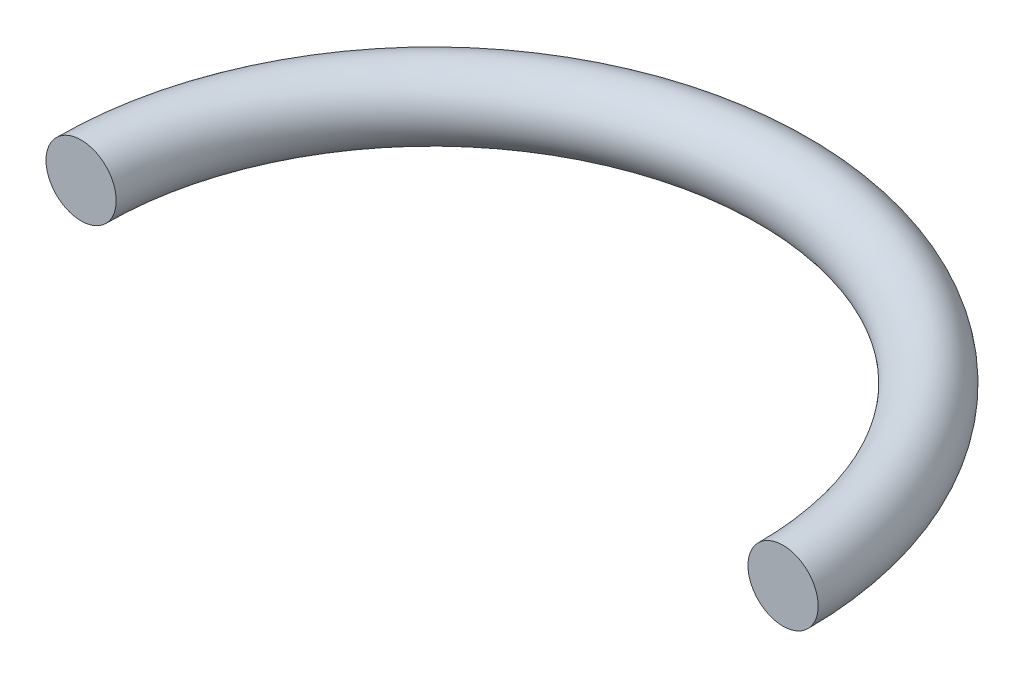
ISO-10303-21;
HEADER;
FILE_DESCRIPTION(('STEP AP214'),'2;1');
FILE_NAME('part.step','',(''),(''),'','','');
FILE_SCHEMA(('AUTOMOTIVE_DESIGN { 1 0 10303 214 1 1 1 1 }'));
ENDSEC;
DATA;
#1=APPLICATION_CONTEXT('core data for automotive mechanical design processes');
#2=APPLICATION_PROTOCOL_DEFINITION('international standard','automotive_design',2000,#1);
#3=PRODUCT_CONTEXT('',#1,'mechanical');
#4=PRODUCT('Part','Part','',(#3));
#5=PRODUCT_RELATED_PRODUCT_CATEGORY('part','',(#4));
#6=PRODUCT_DEFINITION_FORMATION('','',#4);
#7=PRODUCT_DEFINITION_CONTEXT('part definition',#1,'design');
#8=PRODUCT_DEFINITION('design','',#6,#7);
#9=PRODUCT_DEFINITION_SHAPE('','',#8);
#10=(LENGTH_UNIT() NAMED_UNIT(*) SI_UNIT(.MILLI.,.METRE.));
#11=(NAMED_UNIT(*) PLANE_ANGLE_UNIT() SI_UNIT($,.RADIAN.));
#12=(NAMED_UNIT(*) SI_UNIT($,.STERADIAN.) SOLID_ANGLE_UNIT());
#13=UNCERTAINTY_MEASURE_WITH_UNIT(LENGTH_MEASURE(1.E-05),#10,'distance_accuracy_value','');
#14=(GEOMETRIC_REPRESENTATION_CONTEXT(3) GLOBAL_UNCERTAINTY_ASSIGNED_CONTEXT((#13)) GLOBAL_UNIT_ASSIGNED_CONTEXT((#10,
#11,#12)) REPRESENTATION_CONTEXT('',''));
#15=CARTESIAN_POINT('',(0.,0.,0.));
#16=DIRECTION('',(0.,0.,1.));
#17=DIRECTION('',(1.,0.,0.));
#18=AXIS2_PLACEMENT_3D('',#15,#16,#17);
#19=CARTESIAN_POINT('',(0.,0.,0.));
#20=DIRECTION('',(0.,-1.,0.));
#21=DIRECTION('',(0.,0.,-1.));
#22=AXIS2_PLACEMENT_3D('',#19,#20,#21);
#23=TOROIDAL_SURFACE('',#22,50.,5.);
#24=CARTESIAN_POINT('',(-50.,0.,3.49148133884313E-13));
#25=DIRECTION('',(0.,0.,-1.));
#26=DIRECTION('',(-1.,0.,0.));
#27=AXIS2_PLACEMENT_3D('',#24,#25,#26);
#28=CIRCLE('',#27,5.);
#29=CARTESIAN_POINT('',(-55.,0.,3.84062947272745E-13));
#30=VERTEX_POINT('',#29);
#31=EDGE_CURVE('E10',#30,#30,#28,.T.);
#32=CARTESIAN_POINT('',(50.,0.,0.));
#33=DIRECTION('',(0.,0.,1.));
#34=DIRECTION('',(1.,0.,0.));
#35=AXIS2_PLACEMENT_3D('',#32,#33,#34);
#36=CIRCLE('',#35,5.);
#37=CARTESIAN_POINT('',(55.,0.,0.));
#38=VERTEX_POINT('',#37);
#39=EDGE_CURVE('E36',#38,#38,#36,.T.);
#40=CARTESIAN_POINT('',(0.,0.,0.));
#41=DIRECTION('',(0.,-1.,0.));
#42=DIRECTION('',(0.,0.,-1.));
#43=AXIS2_PLACEMENT_3D('',#40,#41,#42);
#44=CIRCLE('',#43,55.);
#45=EDGE_CURVE('',#30,#38,#44,.T.);
#46=ORIENTED_EDGE('',*,*,#31,.T.);
#47=ORIENTED_EDGE('',*,*,#39,.F.);
#48=ORIENTED_EDGE('',*,*,#45,.T.);
#49=ORIENTED_EDGE('',*,*,#45,.F.);
#50=EDGE_LOOP('',(#46,#48,#47,#49));
#51=FACE_BOUND('',#50,.T.);
#52=ADVANCED_FACE('F30',(#51),#23,.T.);
#53=CARTESIAN_POINT('',(-50.,0.,3.49148133884313E-13));
#54=DIRECTION('',(0.,0.,-1.));
#55=DIRECTION('',(-1.,0.,0.));
#56=AXIS2_PLACEMENT_3D('',#53,#54,#55);
#57=PLANE('',#56);
#58=ORIENTED_EDGE('',*,*,#31,.F.);
#59=EDGE_LOOP('',(#58));
#60=FACE_BOUND('',#59,.T.);
#61=ADVANCED_FACE('F45',(#60),#57,.F.);
#62=CARTESIAN_POINT('',(50.,0.,0.));
#63=DIRECTION('',(0.,0.,1.));
#64=DIRECTION('',(1.,0.,0.));
#65=AXIS2_PLACEMENT_3D('',#62,#63,#64);
#66=PLANE('',#65);
#67=ORIENTED_EDGE('',*,*,#39,.T.);
#68=EDGE_LOOP('',(#67));
#69=FACE_BOUND('',#68,.T.);
#70=ADVANCED_FACE('F42',(#69),#66,.T.);
#71=CLOSED_SHELL('',(#52,#61,#70));
#72=MANIFOLD_SOLID_BREP('B2',#71);
#73=ADVANCED_BREP_SHAPE_REPRESENTATION('',(#18,#72),#14);
#74=SHAPE_DEFINITION_REPRESENTATION(#9,#73);
ENDSEC;
END-ISO-10303-21;
